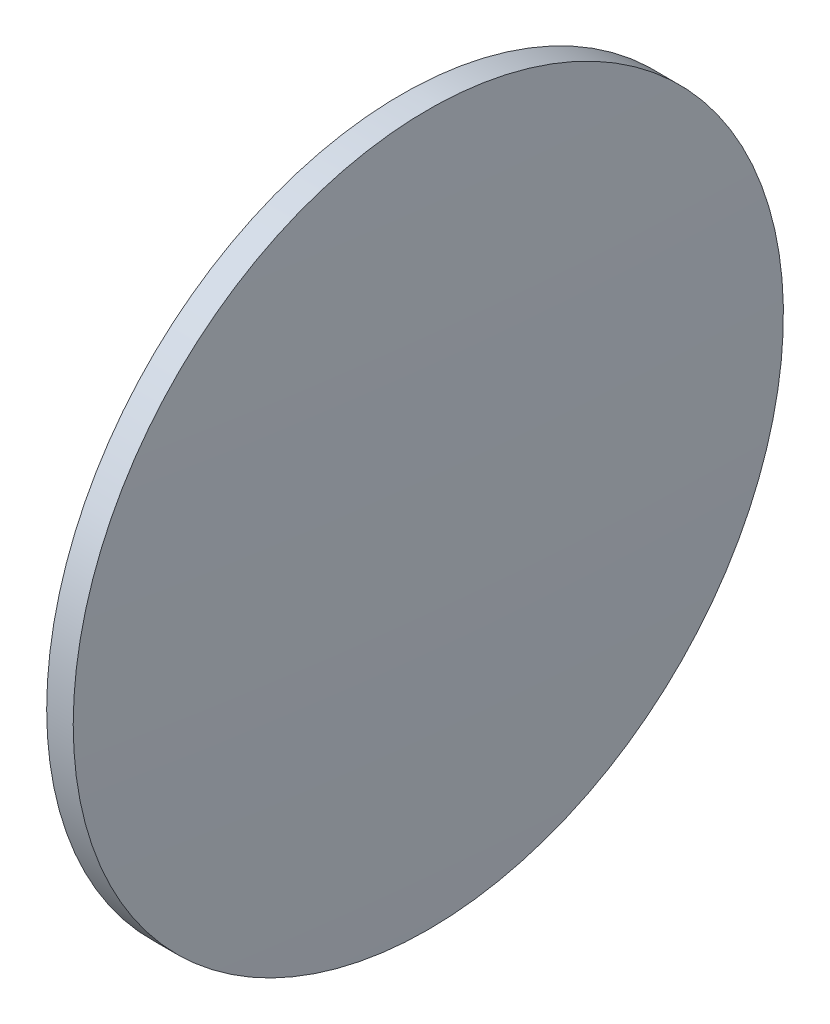
ISO-10303-21;
HEADER;
FILE_DESCRIPTION(('STEP AP214'),'2;1');
FILE_NAME('part.step','',(''),(''),'','','');
FILE_SCHEMA(('AUTOMOTIVE_DESIGN { 1 0 10303 214 1 1 1 1 }'));
ENDSEC;
DATA;
#1=APPLICATION_CONTEXT('core data for automotive mechanical design processes');
#2=APPLICATION_PROTOCOL_DEFINITION('international standard','automotive_design',2000,#1);
#3=PRODUCT_CONTEXT('',#1,'mechanical');
#4=PRODUCT('Part','Part','',(#3));
#5=PRODUCT_RELATED_PRODUCT_CATEGORY('part','',(#4));
#6=PRODUCT_DEFINITION_FORMATION('','',#4);
#7=PRODUCT_DEFINITION_CONTEXT('part definition',#1,'design');
#8=PRODUCT_DEFINITION('design','',#6,#7);
#9=PRODUCT_DEFINITION_SHAPE('','',#8);
#10=(LENGTH_UNIT() NAMED_UNIT(*) SI_UNIT(.MILLI.,.METRE.));
#11=(NAMED_UNIT(*) PLANE_ANGLE_UNIT() SI_UNIT($,.RADIAN.));
#12=(NAMED_UNIT(*) SI_UNIT($,.STERADIAN.) SOLID_ANGLE_UNIT());
#13=UNCERTAINTY_MEASURE_WITH_UNIT(LENGTH_MEASURE(1.E-05),#10,'distance_accuracy_value','');
#14=(GEOMETRIC_REPRESENTATION_CONTEXT(3) GLOBAL_UNCERTAINTY_ASSIGNED_CONTEXT((#13)) GLOBAL_UNIT_ASSIGNED_CONTEXT((#10,
#11,#12)) REPRESENTATION_CONTEXT('',''));
#15=CARTESIAN_POINT('',(0.,0.,0.));
#16=DIRECTION('',(0.,0.,1.));
#17=DIRECTION('',(1.,0.,0.));
#18=AXIS2_PLACEMENT_3D('',#15,#16,#17);
#19=CARTESIAN_POINT('',(-799.429912622641,130.041890759926,0.));
#20=DIRECTION('',(-1.,0.,0.));
#21=DIRECTION('',(0.,-1.,0.));
#22=AXIS2_PLACEMENT_3D('',#19,#20,#21);
#23=SPHERICAL_SURFACE('',#22,1039.3460389611);
#24=CARTESIAN_POINT('',(239.14612633846,130.041890759925,0.));
#25=DIRECTION('',(-1.,0.,0.));
#26=DIRECTION('',(0.,0.,1.));
#27=AXIS2_PLACEMENT_3D('',#24,#25,#26);
#28=CIRCLE('',#27,40.);
#29=CARTESIAN_POINT('',(239.14612633846,130.041890759925,40.));
#30=VERTEX_POINT('',#29);
#31=EDGE_CURVE('E10',#30,#30,#28,.T.);
#32=ORIENTED_EDGE('',*,*,#31,.F.);
#33=EDGE_LOOP('',(#32));
#34=FACE_BOUND('',#33,.T.);
#35=ADVANCED_FACE('F33',(#34),#23,.T.);
#36=CARTESIAN_POINT('',(217.331148660887,130.041890759925,0.));
#37=DIRECTION('',(-1.,0.,0.));
#38=DIRECTION('',(0.,0.,1.));
#39=AXIS2_PLACEMENT_3D('',#36,#37,#38);
#40=CYLINDRICAL_SURFACE('',#39,40.);
#41=CARTESIAN_POINT('',(236.15612633846,130.041890759925,0.));
#42=DIRECTION('',(-1.,0.,0.));
#43=DIRECTION('',(0.,0.,1.));
#44=AXIS2_PLACEMENT_3D('',#41,#42,#43);
#45=CIRCLE('',#44,40.);
#46=CARTESIAN_POINT('',(236.15612633846,130.041890759925,40.));
#47=VERTEX_POINT('',#46);
#48=EDGE_CURVE('E39',#47,#47,#45,.T.);
#49=ORIENTED_EDGE('',*,*,#48,.F.);
#50=EDGE_LOOP('',(#49));
#51=FACE_BOUND('',#50,.T.);
#52=ORIENTED_EDGE('',*,*,#31,.T.);
#53=EDGE_LOOP('',(#52));
#54=FACE_BOUND('',#53,.T.);
#55=ADVANCED_FACE('F47',(#51,#54),#40,.T.);
#56=CARTESIAN_POINT('',(236.15612633846,130.041890759925,0.));
#57=DIRECTION('',(1.,0.,0.));
#58=DIRECTION('',(0.,0.,-1.));
#59=AXIS2_PLACEMENT_3D('',#56,#57,#58);
#60=PLANE('',#59);
#61=ORIENTED_EDGE('',*,*,#48,.T.);
#62=EDGE_LOOP('',(#61));
#63=FACE_BOUND('',#62,.T.);
#64=ADVANCED_FACE('F45',(#63),#60,.F.);
#65=CLOSED_SHELL('',(#35,#55,#64));
#66=MANIFOLD_SOLID_BREP('B2',#65);
#67=ADVANCED_BREP_SHAPE_REPRESENTATION('',(#18,#66),#14);
#68=SHAPE_DEFINITION_REPRESENTATION(#9,#67);
ENDSEC;
END-ISO-10303-21;
